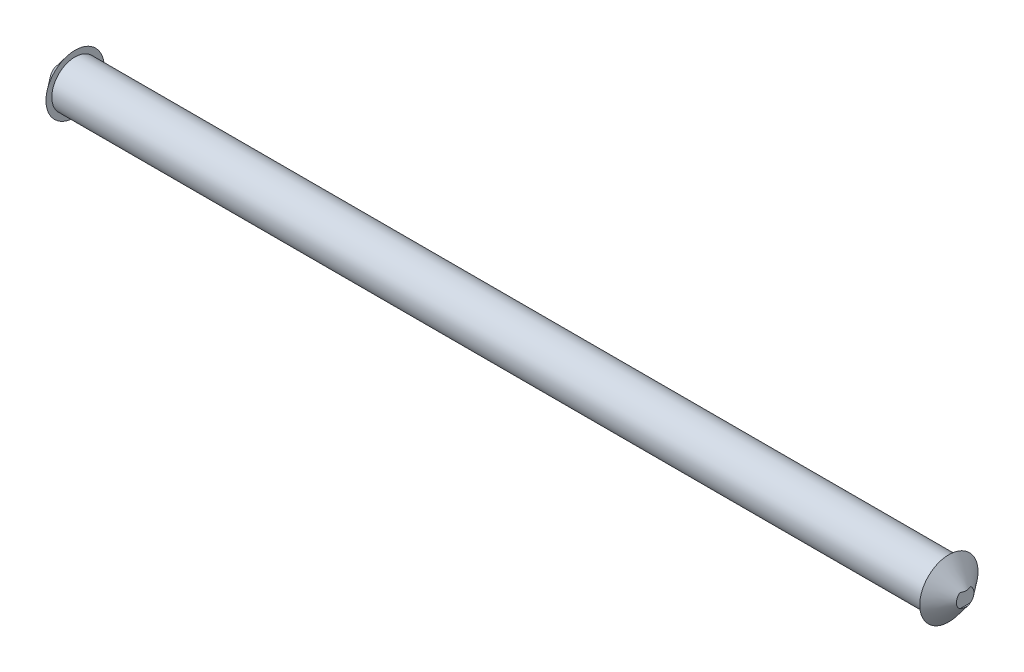
ISO-10303-21;
HEADER;
FILE_DESCRIPTION(('STEP AP214'),'2;1');
FILE_NAME('part.step','',(''),(''),'','','');
FILE_SCHEMA(('AUTOMOTIVE_DESIGN { 1 0 10303 214 1 1 1 1 }'));
ENDSEC;
DATA;
#1=APPLICATION_CONTEXT('core data for automotive mechanical design processes');
#2=APPLICATION_PROTOCOL_DEFINITION('international standard','automotive_design',2000,#1);
#3=PRODUCT_CONTEXT('',#1,'mechanical');
#4=PRODUCT('Part','Part','',(#3));
#5=PRODUCT_RELATED_PRODUCT_CATEGORY('part','',(#4));
#6=PRODUCT_DEFINITION_FORMATION('','',#4);
#7=PRODUCT_DEFINITION_CONTEXT('part definition',#1,'design');
#8=PRODUCT_DEFINITION('design','',#6,#7);
#9=PRODUCT_DEFINITION_SHAPE('','',#8);
#10=(LENGTH_UNIT() NAMED_UNIT(*) SI_UNIT(.MILLI.,.METRE.));
#11=(NAMED_UNIT(*) PLANE_ANGLE_UNIT() SI_UNIT($,.RADIAN.));
#12=(NAMED_UNIT(*) SI_UNIT($,.STERADIAN.) SOLID_ANGLE_UNIT());
#13=UNCERTAINTY_MEASURE_WITH_UNIT(LENGTH_MEASURE(1.E-05),#10,'distance_accuracy_value','');
#14=(GEOMETRIC_REPRESENTATION_CONTEXT(3) GLOBAL_UNCERTAINTY_ASSIGNED_CONTEXT((#13)) GLOBAL_UNIT_ASSIGNED_CONTEXT((#10,
#11,#12)) REPRESENTATION_CONTEXT('',''));
#15=CARTESIAN_POINT('',(0.,0.,0.));
#16=DIRECTION('',(0.,0.,1.));
#17=DIRECTION('',(1.,0.,0.));
#18=AXIS2_PLACEMENT_3D('',#15,#16,#17);
#19=CARTESIAN_POINT('',(197.5,0.,0.));
#20=DIRECTION('',(-1.,0.,0.));
#21=DIRECTION('',(0.,0.,1.));
#22=AXIS2_PLACEMENT_3D('',#19,#20,#21);
#23=CONICAL_SURFACE('',#22,0.,0.896055384571344);
#24=CARTESIAN_POINT('',(187.5,0.,0.));
#25=DIRECTION('',(1.,0.,0.));
#26=DIRECTION('',(0.,0.,-1.));
#27=AXIS2_PLACEMENT_3D('',#24,#25,#26);
#28=CIRCLE('',#27,12.5);
#29=CARTESIAN_POINT('',(187.5,0.,-12.5));
#30=VERTEX_POINT('',#29);
#31=EDGE_CURVE('E152',#30,#30,#28,.T.);
#32=ORIENTED_EDGE('',*,*,#31,.T.);
#33=EDGE_LOOP('',(#32));
#34=FACE_BOUND('',#33,.T.);
#35=CARTESIAN_POINT('',(194.492262498379,0.,0.));
#36=DIRECTION('',(1.,0.,0.));
#37=DIRECTION('',(0.,0.,-1.));
#38=AXIS2_PLACEMENT_3D('',#35,#36,#37);
#39=CIRCLE('',#38,3.75967187702584);
#40=CARTESIAN_POINT('',(194.492262498379,-3.,2.26608310149892));
#41=VERTEX_POINT('',#40);
#42=CARTESIAN_POINT('',(194.492262498379,3.,2.26608310149892));
#43=VERTEX_POINT('',#42);
#44=EDGE_CURVE('E191',#41,#43,#39,.F.);
#45=ORIENTED_EDGE('',*,*,#44,.T.);
#46=CARTESIAN_POINT('',(183.29670557517,3.,-17.498820161943));
#47=CARTESIAN_POINT('',(183.646234391443,3.,-17.0555179935507));
#48=CARTESIAN_POINT('',(183.995545128925,3.,-16.6120435251189));
#49=CARTESIAN_POINT('',(184.69396813607,3.,-15.7241231606544));
#50=CARTESIAN_POINT('',(185.04307973024,3.,-15.2796767333548));
#51=CARTESIAN_POINT('',(185.747038564179,3.,-14.381913889352));
#52=CARTESIAN_POINT('',(186.101871619006,3.,-13.9285863459219));
#53=CARTESIAN_POINT('',(186.810094596255,3.,-13.0216350247952));
#54=CARTESIAN_POINT('',(187.163485701352,3.,-12.5680121711122));
#55=CARTESIAN_POINT('',(187.842502975226,3.,-11.6936000997054));
#56=CARTESIAN_POINT('',(188.168230895602,3.,-11.2728899332515));
#57=CARTESIAN_POINT('',(188.818068938484,3.,-10.4301266225083));
#58=CARTESIAN_POINT('',(189.142178828134,3.,-10.0080732984622));
#59=CARTESIAN_POINT('',(189.789498721798,3.,-9.16021866132439));
#60=CARTESIAN_POINT('',(190.112697844814,3.,-8.73440903445055));
#61=CARTESIAN_POINT('',(190.755359624353,3.,-7.88033402089903));
#62=CARTESIAN_POINT('',(191.074824231114,3.,-7.45207010760142));
#63=CARTESIAN_POINT('',(191.546884463677,3.,-6.81036930304345));
#64=CARTESIAN_POINT('',(191.701654430611,3.,-6.59853318284215));
#65=CARTESIAN_POINT('',(192.009381603457,3.,-6.17354986377727));
#66=CARTESIAN_POINT('',(192.162338829091,3.,-5.96040267921702));
#67=CARTESIAN_POINT('',(192.466192956135,3.,-5.53194212297761));
#68=CARTESIAN_POINT('',(192.617084643465,3.,-5.3166250439403));
#69=CARTESIAN_POINT('',(192.91557401778,3.,-4.88375423999881));
#70=CARTESIAN_POINT('',(193.063172114143,3.,-4.66620079802892));
#71=CARTESIAN_POINT('',(193.352453169119,3.,-4.23003164929146));
#72=CARTESIAN_POINT('',(193.494177881932,3.,-4.0114438574961));
#73=CARTESIAN_POINT('',(193.701848448034,3.,-3.68038056305878));
#74=CARTESIAN_POINT('',(193.77027306688,3.,-3.56946087341555));
#75=CARTESIAN_POINT('',(193.905075033848,3.,-3.34638658063015));
#76=CARTESIAN_POINT('',(193.971452464872,3.,-3.2342320277442));
#77=CARTESIAN_POINT('',(194.101433445878,3.,-3.00887788216624));
#78=CARTESIAN_POINT('',(194.165046395956,3.,-2.89568372891006));
#79=CARTESIAN_POINT('',(194.28912995747,3.,-2.66756161620629));
#80=CARTESIAN_POINT('',(194.349600240848,3.,-2.55263347736041));
#81=CARTESIAN_POINT('',(194.466487688932,3.,-2.32088689022504));
#82=CARTESIAN_POINT('',(194.522909316914,3.,-2.20407070304926));
#83=CARTESIAN_POINT('',(194.630669571733,3.,-1.96812892134171));
#84=CARTESIAN_POINT('',(194.682009825058,3.,-1.8490040804778));
#85=CARTESIAN_POINT('',(194.742321669116,3.,-1.69799414400983));
#86=CARTESIAN_POINT('',(194.75433235337,3.,-1.66731318131802));
#87=CARTESIAN_POINT('',(194.777908383138,3.,-1.60577580406672));
#88=CARTESIAN_POINT('',(194.789473669251,3.,-1.57491936673085));
#89=CARTESIAN_POINT('',(194.823463236899,3.,-1.48207409866269));
#90=CARTESIAN_POINT('',(194.845175968993,3.,-1.41982241691833));
#91=CARTESIAN_POINT('',(194.886456565193,3.,-1.29463418022196));
#92=CARTESIAN_POINT('',(194.906025176515,3.,-1.23169787231789));
#93=CARTESIAN_POINT('',(194.942772097364,3.,-1.10513008154927));
#94=CARTESIAN_POINT('',(194.959950473655,3.,-1.04149861815529));
#95=CARTESIAN_POINT('',(194.991240963676,3.,-0.915248370047356));
#96=CARTESIAN_POINT('',(195.005421575452,3.,-0.852646682951467));
#97=CARTESIAN_POINT('',(195.031035634412,3.,-0.726888963503941));
#98=CARTESIAN_POINT('',(195.042469149841,3.,-0.663732944963658));
#99=CARTESIAN_POINT('',(195.072319300957,3.,-0.473517333743749));
#100=CARTESIAN_POINT('',(195.086283868659,3.,-0.345716758217381));
#101=CARTESIAN_POINT('',(195.101259741742,3.,-0.0868271347396765));
#102=CARTESIAN_POINT('',(195.102010644423,3.,0.0442771233320055));
#103=CARTESIAN_POINT('',(195.08982565588,3.,0.305808048191539));
#104=CARTESIAN_POINT('',(195.076892366451,3.,0.436234839049961));
#105=CARTESIAN_POINT('',(195.038324845377,3.,0.69645019059733));
#106=CARTESIAN_POINT('',(195.012567863331,3.,0.826220092594126));
#107=CARTESIAN_POINT('',(194.950252556368,3.,1.08312294661594));
#108=CARTESIAN_POINT('',(194.913690881168,3.,1.21025506762181));
#109=CARTESIAN_POINT('',(194.824411257637,3.,1.48460573672424));
#110=CARTESIAN_POINT('',(194.769962268817,3.,1.63125339196155));
#111=CARTESIAN_POINT('',(194.651934921077,3.,1.92086546794607));
#112=CARTESIAN_POINT('',(194.588350751728,3.,2.06382747565741));
#113=CARTESIAN_POINT('',(194.454267991559,3.,2.34681155462035));
#114=CARTESIAN_POINT('',(194.38375494006,3.,2.48682670375053));
#115=CARTESIAN_POINT('',(194.237656941281,3.,2.76412356604441));
#116=CARTESIAN_POINT('',(194.16207312467,3.,2.90140587977538));
#117=CARTESIAN_POINT('',(194.005837868725,3.,3.1758881193021));
#118=CARTESIAN_POINT('',(193.925125750963,3.,3.31305332246463));
#119=CARTESIAN_POINT('',(193.760644288864,3.,3.58553800919421));
#120=CARTESIAN_POINT('',(193.676874821476,3.,3.72085741816936));
#121=CARTESIAN_POINT('',(193.507076003445,3.,3.98979113633031));
#122=CARTESIAN_POINT('',(193.421050118672,3.,4.12340764017016));
#123=CARTESIAN_POINT('',(193.247115787703,3.,4.38940066629322));
#124=CARTESIAN_POINT('',(193.159207401809,3.,4.52177722810157));
#125=CARTESIAN_POINT('',(192.959347592394,3.,4.81901704283908));
#126=CARTESIAN_POINT('',(192.846962569453,3.,4.98358841543047));
#127=CARTESIAN_POINT('',(192.620343194152,3.,5.3114543391612));
#128=CARTESIAN_POINT('',(192.506108806134,3.,5.47474886559194));
#129=CARTESIAN_POINT('',(192.16122044069,3.,5.9631224272327));
#130=CARTESIAN_POINT('',(191.928396938732,3.,6.28666838699631));
#131=CARTESIAN_POINT('',(191.458941350057,3.,6.93109380833911));
#132=CARTESIAN_POINT('',(191.2223083358,3.,7.25197259077142));
#133=CARTESIAN_POINT('',(190.746437263315,3.,7.89179630427862));
#134=CARTESIAN_POINT('',(190.507199174403,3.,8.21074121250619));
#135=CARTESIAN_POINT('',(190.026522717104,3.,8.84766957432572));
#136=CARTESIAN_POINT('',(189.785081731392,3.,9.16565104966052));
#137=CARTESIAN_POINT('',(189.300808208052,3.,9.80055652373662));
#138=CARTESIAN_POINT('',(189.057975657228,3.,10.1174805124039));
#139=CARTESIAN_POINT('',(188.327990950273,3.,11.0669494780455));
#140=CARTESIAN_POINT('',(187.839275478818,3.,11.6982920089966));
#141=CARTESIAN_POINT('',(186.918454070048,3.,12.8828800643966));
#142=CARTESIAN_POINT('',(186.486637707102,3.,13.4363511644426));
#143=CARTESIAN_POINT('',(185.621598591811,3.,14.5422356630212));
#144=CARTESIAN_POINT('',(185.188375773378,3.,15.0946490098551));
#145=CARTESIAN_POINT('',(184.321828877846,3.,16.197564151436));
#146=CARTESIAN_POINT('',(183.888506831661,3.,16.7480675428355));
#147=CARTESIAN_POINT('',(183.021133032432,3.,17.848453520256));
#148=CARTESIAN_POINT('',(182.587081317911,3.,18.3983361366382));
#149=CARTESIAN_POINT('',(182.152771170339,3.,18.9480141089198));
#150=B_SPLINE_CURVE_WITH_KNOTS('',3,(#46,#47,#48,#49,#50,#51,#52,#53,#54,#55,#56,#57,#58,#59,
#60,#61,#62,#63,#64,#65,#66,#67,#68,#69,#70,#71,#72,#73,#74,#75,#76,#77,#78,#79,#80,#81,#82,#83,
#84,#85,#86,#87,#88,#89,#90,#91,#92,#93,#94,#95,#96,#97,#98,#99,#100,#101,#102,#103,#104,#105,
#106,#107,#108,#109,#110,#111,#112,#113,#114,#115,#116,#117,#118,#119,#120,#121,#122,#123,#124,
#125,#126,#127,#128,#129,#130,#131,#132,#133,#134,#135,#136,#137,#138,#139,#140,#141,#142,#143,
#144,#145,#146,#147,#148,#149),.UNSPECIFIED.,.F.,.F.,(4,2,2,2,2,2,2,2,2,2,2,2,2,2,2,2,2,2,2,2,2,
2,2,2,2,2,2,2,2,2,2,2,2,2,2,2,2,2,2,2,2,2,2,2,2,2,2,2,2,2,2,4),(0.,1.69357197501904,
3.38906656656963,5.11611822599625,6.84120473489183,8.4374042009055,10.033827116217,
11.6375454851175,13.2403851528,14.0274324705301,14.8144712169746,15.6032244552613,
16.3918791031052,17.1733205119163,17.5642844646491,17.9552325643917,18.3447263687838,
18.7342607503941,19.1233588895411,19.5123320773973,19.6111738138473,19.710028686806,
19.907780777976,20.1054637328776,20.3031411650112,20.4956436556128,20.6881413634888,
21.0731570506091,21.465751956047,21.8582722302477,22.2546241707396,22.6510991398652,
23.1199665045592,23.5891334233758,24.0593011815282,24.5293644489147,25.0067637560353,
25.4841822989109,25.9609061219201,26.437614696519,27.0354496607616,27.6332961653832,
28.8290728077067,30.0251451379679,31.2212315715303,32.4189970950164,33.6167739964968,
36.0119492030726,38.1179292684814,40.2240097646661,42.3257697499059,44.4274220540545),.UNSPECIFIED.);
#151=CARTESIAN_POINT('',(194.492262498379,3.,-2.26608310149892));
#152=VERTEX_POINT('',#151);
#153=EDGE_CURVE('E88',#43,#152,#150,.F.);
#154=ORIENTED_EDGE('',*,*,#153,.T.);
#155=CARTESIAN_POINT('',(194.492262498379,-3.,-2.26608310149892));
#156=VERTEX_POINT('',#155);
#157=EDGE_CURVE('E164',#152,#156,#39,.F.);
#158=ORIENTED_EDGE('',*,*,#157,.T.);
#159=CARTESIAN_POINT('',(183.29670557517,-3.,-17.498820161943));
#160=CARTESIAN_POINT('',(183.646234391443,-3.,-17.0555179935507));
#161=CARTESIAN_POINT('',(183.995545128925,-3.,-16.6120435251189));
#162=CARTESIAN_POINT('',(184.69396813607,-3.,-15.7241231606544));
#163=CARTESIAN_POINT('',(185.04307973024,-3.,-15.2796767333548));
#164=CARTESIAN_POINT('',(185.747038564179,-3.,-14.381913889352));
#165=CARTESIAN_POINT('',(186.101871619006,-3.,-13.9285863459219));
#166=CARTESIAN_POINT('',(186.810094596255,-3.,-13.0216350247952));
#167=CARTESIAN_POINT('',(187.163485701352,-3.,-12.5680121711122));
#168=CARTESIAN_POINT('',(187.842502975226,-3.,-11.6936000997054));
#169=CARTESIAN_POINT('',(188.168230895602,-3.,-11.2728899332515));
#170=CARTESIAN_POINT('',(188.818068938484,-3.,-10.4301266225083));
#171=CARTESIAN_POINT('',(189.142178828134,-3.,-10.0080732984622));
#172=CARTESIAN_POINT('',(189.789498721798,-3.,-9.16021866132439));
#173=CARTESIAN_POINT('',(190.112697844814,-3.,-8.73440903445055));
#174=CARTESIAN_POINT('',(190.755359624353,-3.,-7.88033402089903));
#175=CARTESIAN_POINT('',(191.074824231114,-3.,-7.45207010760142));
#176=CARTESIAN_POINT('',(191.546884463677,-3.,-6.81036930304345));
#177=CARTESIAN_POINT('',(191.701654430611,-3.,-6.59853318284215));
#178=CARTESIAN_POINT('',(192.009381603457,-3.,-6.17354986377727));
#179=CARTESIAN_POINT('',(192.162338829091,-3.,-5.96040267921702));
#180=CARTESIAN_POINT('',(192.466192956135,-3.,-5.53194212297761));
#181=CARTESIAN_POINT('',(192.617084643465,-3.,-5.3166250439403));
#182=CARTESIAN_POINT('',(192.91557401778,-3.,-4.88375423999881));
#183=CARTESIAN_POINT('',(193.063172114143,-3.,-4.66620079802892));
#184=CARTESIAN_POINT('',(193.352453169119,-3.,-4.23003164929146));
#185=CARTESIAN_POINT('',(193.494177881932,-3.,-4.0114438574961));
#186=CARTESIAN_POINT('',(193.701848448034,-3.,-3.68038056305878));
#187=CARTESIAN_POINT('',(193.77027306688,-3.,-3.56946087341555));
#188=CARTESIAN_POINT('',(193.905075033848,-3.,-3.34638658063015));
#189=CARTESIAN_POINT('',(193.971452464872,-3.,-3.2342320277442));
#190=CARTESIAN_POINT('',(194.101433445878,-3.,-3.00887788216624));
#191=CARTESIAN_POINT('',(194.165046395956,-3.,-2.89568372891006));
#192=CARTESIAN_POINT('',(194.28912995747,-3.,-2.66756161620629));
#193=CARTESIAN_POINT('',(194.349600240848,-3.,-2.55263347736041));
#194=CARTESIAN_POINT('',(194.466487688932,-3.,-2.32088689022504));
#195=CARTESIAN_POINT('',(194.522909316914,-3.,-2.20407070304926));
#196=CARTESIAN_POINT('',(194.630669571733,-3.,-1.96812892134171));
#197=CARTESIAN_POINT('',(194.682009825058,-3.,-1.8490040804778));
#198=CARTESIAN_POINT('',(194.742321669116,-3.,-1.69799414400983));
#199=CARTESIAN_POINT('',(194.75433235337,-3.,-1.66731318131802));
#200=CARTESIAN_POINT('',(194.777908383138,-3.,-1.60577580406672));
#201=CARTESIAN_POINT('',(194.789473669251,-3.,-1.57491936673085));
#202=CARTESIAN_POINT('',(194.823463236899,-3.,-1.48207409866269));
#203=CARTESIAN_POINT('',(194.845175968993,-3.,-1.41982241691833));
#204=CARTESIAN_POINT('',(194.886456565193,-3.,-1.29463418022196));
#205=CARTESIAN_POINT('',(194.906025176515,-3.,-1.23169787231789));
#206=CARTESIAN_POINT('',(194.942772097364,-3.,-1.10513008154927));
#207=CARTESIAN_POINT('',(194.959950473655,-3.,-1.04149861815529));
#208=CARTESIAN_POINT('',(194.991240963676,-3.,-0.915248370047356));
#209=CARTESIAN_POINT('',(195.005421575452,-3.,-0.852646682951467));
#210=CARTESIAN_POINT('',(195.031035634412,-3.,-0.726888963503941));
#211=CARTESIAN_POINT('',(195.042469149841,-3.,-0.663732944963658));
#212=CARTESIAN_POINT('',(195.072319300957,-3.,-0.473517333743749));
#213=CARTESIAN_POINT('',(195.086283868659,-3.,-0.345716758217381));
#214=CARTESIAN_POINT('',(195.101259741742,-3.,-0.0868271347396765));
#215=CARTESIAN_POINT('',(195.102010644423,-3.,0.0442771233320055));
#216=CARTESIAN_POINT('',(195.08982565588,-3.,0.305808048191539));
#217=CARTESIAN_POINT('',(195.076892366451,-3.,0.436234839049961));
#218=CARTESIAN_POINT('',(195.038324845377,-3.,0.69645019059733));
#219=CARTESIAN_POINT('',(195.012567863331,-3.,0.826220092594126));
#220=CARTESIAN_POINT('',(194.950252556368,-3.,1.08312294661594));
#221=CARTESIAN_POINT('',(194.913690881168,-3.,1.21025506762181));
#222=CARTESIAN_POINT('',(194.824411257637,-3.,1.48460573672424));
#223=CARTESIAN_POINT('',(194.769962268817,-3.,1.63125339196155));
#224=CARTESIAN_POINT('',(194.651934921077,-3.,1.92086546794607));
#225=CARTESIAN_POINT('',(194.588350751728,-3.,2.06382747565741));
#226=CARTESIAN_POINT('',(194.454267991559,-3.,2.34681155462035));
#227=CARTESIAN_POINT('',(194.38375494006,-3.,2.48682670375053));
#228=CARTESIAN_POINT('',(194.237656941281,-3.,2.76412356604441));
#229=CARTESIAN_POINT('',(194.16207312467,-3.,2.90140587977538));
#230=CARTESIAN_POINT('',(194.005837868725,-3.,3.1758881193021));
#231=CARTESIAN_POINT('',(193.925125750963,-3.,3.31305332246463));
#232=CARTESIAN_POINT('',(193.760644288864,-3.,3.58553800919421));
#233=CARTESIAN_POINT('',(193.676874821476,-3.,3.72085741816936));
#234=CARTESIAN_POINT('',(193.507076003445,-3.,3.98979113633031));
#235=CARTESIAN_POINT('',(193.421050118672,-3.,4.12340764017016));
#236=CARTESIAN_POINT('',(193.247115787703,-3.,4.38940066629322));
#237=CARTESIAN_POINT('',(193.159207401809,-3.,4.52177722810157));
#238=CARTESIAN_POINT('',(192.959347592394,-3.,4.81901704283908));
#239=CARTESIAN_POINT('',(192.846962569453,-3.,4.98358841543047));
#240=CARTESIAN_POINT('',(192.620343194152,-3.,5.3114543391612));
#241=CARTESIAN_POINT('',(192.506108806134,-3.,5.47474886559194));
#242=CARTESIAN_POINT('',(192.16122044069,-3.,5.9631224272327));
#243=CARTESIAN_POINT('',(191.928396938732,-3.,6.28666838699631));
#244=CARTESIAN_POINT('',(191.458941350057,-3.,6.93109380833911));
#245=CARTESIAN_POINT('',(191.2223083358,-3.,7.25197259077142));
#246=CARTESIAN_POINT('',(190.746437263315,-3.,7.89179630427862));
#247=CARTESIAN_POINT('',(190.507199174403,-3.,8.21074121250619));
#248=CARTESIAN_POINT('',(190.026522717104,-3.,8.84766957432572));
#249=CARTESIAN_POINT('',(189.785081731392,-3.,9.16565104966052));
#250=CARTESIAN_POINT('',(189.300808208052,-3.,9.80055652373662));
#251=CARTESIAN_POINT('',(189.057975657228,-3.,10.1174805124039));
#252=CARTESIAN_POINT('',(188.327990950273,-3.,11.0669494780455));
#253=CARTESIAN_POINT('',(187.839275478818,-3.,11.6982920089966));
#254=CARTESIAN_POINT('',(186.918454070048,-3.,12.8828800643966));
#255=CARTESIAN_POINT('',(186.486637707102,-3.,13.4363511644426));
#256=CARTESIAN_POINT('',(185.621598591811,-3.,14.5422356630212));
#257=CARTESIAN_POINT('',(185.188375773378,-3.,15.0946490098551));
#258=CARTESIAN_POINT('',(184.321828877846,-3.,16.197564151436));
#259=CARTESIAN_POINT('',(183.888506831661,-3.,16.7480675428355));
#260=CARTESIAN_POINT('',(183.021133032432,-3.,17.848453520256));
#261=CARTESIAN_POINT('',(182.587081317911,-3.,18.3983361366382));
#262=CARTESIAN_POINT('',(182.152771170339,-3.,18.9480141089198));
#263=B_SPLINE_CURVE_WITH_KNOTS('',3,(#159,#160,#161,#162,#163,#164,#165,#166,#167,#168,#169,
#170,#171,#172,#173,#174,#175,#176,#177,#178,#179,#180,#181,#182,#183,#184,#185,#186,#187,#188,
#189,#190,#191,#192,#193,#194,#195,#196,#197,#198,#199,#200,#201,#202,#203,#204,#205,#206,#207,
#208,#209,#210,#211,#212,#213,#214,#215,#216,#217,#218,#219,#220,#221,#222,#223,#224,#225,#226,
#227,#228,#229,#230,#231,#232,#233,#234,#235,#236,#237,#238,#239,#240,#241,#242,#243,#244,#245,
#246,#247,#248,#249,#250,#251,#252,#253,#254,#255,#256,#257,#258,#259,#260,#261,#262),
.UNSPECIFIED.,.F.,.F.,(4,2,2,2,2,2,2,2,2,2,2,2,2,2,2,2,2,2,2,2,2,2,2,2,2,2,2,2,2,2,2,2,2,2,2,2,
2,2,2,2,2,2,2,2,2,2,2,2,2,2,2,4),(0.,1.69357197501904,3.38906656656963,5.11611822599625,
6.84120473489183,8.4374042009055,10.033827116217,11.6375454851175,13.2403851528,
14.0274324705301,14.8144712169746,15.6032244552613,16.3918791031052,17.1733205119163,
17.5642844646491,17.9552325643917,18.3447263687838,18.7342607503941,19.1233588895411,
19.5123320773973,19.6111738138473,19.710028686806,19.907780777976,20.1054637328776,
20.3031411650112,20.4956436556128,20.6881413634888,21.0731570506091,21.465751956047,
21.8582722302477,22.2546241707396,22.6510991398652,23.1199665045592,23.5891334233758,
24.0593011815282,24.5293644489147,25.0067637560353,25.4841822989109,25.9609061219201,
26.437614696519,27.0354496607616,27.6332961653832,28.8290728077067,30.0251451379679,
31.2212315715303,32.4189970950164,33.6167739964968,36.0119492030726,38.1179292684814,
40.2240097646661,42.3257697499059,44.4274220540545),.UNSPECIFIED.);
#264=EDGE_CURVE('E158',#156,#41,#263,.T.);
#265=ORIENTED_EDGE('',*,*,#264,.T.);
#266=EDGE_LOOP('',(#45,#154,#158,#265));
#267=FACE_BOUND('',#266,.T.);
#268=ADVANCED_FACE('F39',(#34,#267),#23,.T.);
#269=CARTESIAN_POINT('',(187.5,0.,0.));
#270=DIRECTION('',(-1.,0.,0.));
#271=DIRECTION('',(0.,0.,1.));
#272=AXIS2_PLACEMENT_3D('',#269,#270,#271);
#273=CYLINDRICAL_SURFACE('',#272,10.);
#274=CARTESIAN_POINT('',(187.5,0.,0.));
#275=DIRECTION('',(1.,0.,0.));
#276=DIRECTION('',(0.,0.,-1.));
#277=AXIS2_PLACEMENT_3D('',#274,#275,#276);
#278=CIRCLE('',#277,10.);
#279=CARTESIAN_POINT('',(187.5,0.,-10.));
#280=VERTEX_POINT('',#279);
#281=EDGE_CURVE('E155',#280,#280,#278,.T.);
#282=ORIENTED_EDGE('',*,*,#281,.F.);
#283=EDGE_LOOP('',(#282));
#284=FACE_BOUND('',#283,.T.);
#285=CARTESIAN_POINT('',(-187.5,0.,0.));
#286=DIRECTION('',(-1.,0.,0.));
#287=DIRECTION('',(0.,0.,1.));
#288=AXIS2_PLACEMENT_3D('',#285,#286,#287);
#289=CIRCLE('',#288,10.);
#290=CARTESIAN_POINT('',(-187.5,0.,10.));
#291=VERTEX_POINT('',#290);
#292=EDGE_CURVE('E146',#291,#291,#289,.T.);
#293=ORIENTED_EDGE('',*,*,#292,.F.);
#294=EDGE_LOOP('',(#293));
#295=FACE_BOUND('',#294,.T.);
#296=ADVANCED_FACE('F41',(#284,#295),#273,.T.);
#297=CARTESIAN_POINT('',(187.5,0.,0.));
#298=DIRECTION('',(1.,0.,0.));
#299=DIRECTION('',(0.,0.,-1.));
#300=AXIS2_PLACEMENT_3D('',#297,#298,#299);
#301=PLANE('',#300);
#302=ORIENTED_EDGE('',*,*,#281,.T.);
#303=EDGE_LOOP('',(#302));
#304=FACE_BOUND('',#303,.T.);
#305=ORIENTED_EDGE('',*,*,#31,.F.);
#306=EDGE_LOOP('',(#305));
#307=FACE_BOUND('',#306,.T.);
#308=ADVANCED_FACE('F118',(#304,#307),#301,.F.);
#309=CARTESIAN_POINT('',(-187.5,0.,0.));
#310=DIRECTION('',(-1.,0.,0.));
#311=DIRECTION('',(0.,0.,-1.));
#312=AXIS2_PLACEMENT_3D('',#309,#310,#311);
#313=PLANE('',#312);
#314=ORIENTED_EDGE('',*,*,#292,.T.);
#315=EDGE_LOOP('',(#314));
#316=FACE_BOUND('',#315,.T.);
#317=CARTESIAN_POINT('',(-187.5,0.,0.));
#318=DIRECTION('',(1.,0.,0.));
#319=DIRECTION('',(0.,0.,-1.));
#320=AXIS2_PLACEMENT_3D('',#317,#318,#319);
#321=CIRCLE('',#320,12.5);
#322=CARTESIAN_POINT('',(-187.5,0.,-12.5));
#323=VERTEX_POINT('',#322);
#324=EDGE_CURVE('E136',#323,#323,#321,.T.);
#325=ORIENTED_EDGE('',*,*,#324,.T.);
#326=EDGE_LOOP('',(#325));
#327=FACE_BOUND('',#326,.T.);
#328=ADVANCED_FACE('F116',(#316,#327),#313,.F.);
#329=CARTESIAN_POINT('',(-197.5,0.,0.));
#330=DIRECTION('',(1.,0.,0.));
#331=DIRECTION('',(0.,0.,1.));
#332=AXIS2_PLACEMENT_3D('',#329,#330,#331);
#333=CONICAL_SURFACE('',#332,0.,0.896055384571344);
#334=CARTESIAN_POINT('',(-183.296607290248,-3.,-17.4989448104847));
#335=CARTESIAN_POINT('',(-183.646139414276,-3.,-17.0556385371724));
#336=CARTESIAN_POINT('',(-183.995453460128,-3.,-16.612159964273));
#337=CARTESIAN_POINT('',(-184.693883072902,-3.,-15.7242314071994));
#338=CARTESIAN_POINT('',(-185.042997964361,-3.,-15.2797808917806));
#339=CARTESIAN_POINT('',(-185.746963202005,-3.,-14.3820101190244));
#340=CARTESIAN_POINT('',(-186.101799363825,-3.,-13.92867873541));
#341=CARTESIAN_POINT('',(-186.810028570205,-3.,-13.0217197187344));
#342=CARTESIAN_POINT('',(-187.163422797387,-3.,-12.5680930096475));
#343=CARTESIAN_POINT('',(-187.842444519709,-3.,-11.6936755307394));
#344=CARTESIAN_POINT('',(-188.168173772123,-3.,-11.2729638166269));
#345=CARTESIAN_POINT('',(-188.818014496522,-3.,-10.4301974271077));
#346=CARTESIAN_POINT('',(-189.142125735664,-3.,-10.008142571954));
#347=CARTESIAN_POINT('',(-189.789448299975,-3.,-9.16028497148537));
#348=CARTESIAN_POINT('',(-190.112648744758,-3.,-8.73447391285047));
#349=CARTESIAN_POINT('',(-190.755313224992,-3.,-7.88039606212566));
#350=CARTESIAN_POINT('',(-191.074779210567,-3.,-7.45213074333187));
#351=CARTESIAN_POINT('',(-191.54684168634,-3.,-6.81042772607053));
#352=CARTESIAN_POINT('',(-191.701612482203,-3.,-6.59859077460288));
#353=CARTESIAN_POINT('',(-192.009341340446,-3.,-6.17360581078388));
#354=CARTESIAN_POINT('',(-192.162299422549,-3.,-5.96045781273511));
#355=CARTESIAN_POINT('',(-192.466155288396,-3.,-5.53199567221964));
#356=CARTESIAN_POINT('',(-192.617047858372,-3.,-5.3166778226099));
#357=CARTESIAN_POINT('',(-192.915539055515,-3.,-4.88380551013254));
#358=CARTESIAN_POINT('',(-193.063138092037,-3.,-4.66625133018423));
#359=CARTESIAN_POINT('',(-193.352421161843,-3.,-4.23008067120894));
#360=CARTESIAN_POINT('',(-193.49414694673,-3.,-4.01149210551043));
#361=CARTESIAN_POINT('',(-193.701819214062,-3.,-3.68042769721998));
#362=CARTESIAN_POINT('',(-193.770244414853,-3.,-3.56950764546443));
#363=CARTESIAN_POINT('',(-193.905047586111,-3.,-3.34643264564461));
#364=CARTESIAN_POINT('',(-193.971425639472,-3.,-3.23427774783349));
#365=CARTESIAN_POINT('',(-194.101407924495,-3.,-3.0089229148401));
#366=CARTESIAN_POINT('',(-194.165021555652,-3.,-2.89572841878417));
#367=CARTESIAN_POINT('',(-194.289106542807,-3.,-2.66760564117101));
#368=CARTESIAN_POINT('',(-194.349577570767,-3.,-2.55267718022419));
#369=CARTESIAN_POINT('',(-194.466466590619,-3.,-2.32092996320237));
#370=CARTESIAN_POINT('',(-194.522889045507,-3.,-2.20411346812342));
#371=CARTESIAN_POINT('',(-194.630651054224,-3.,-1.9681710840329));
#372=CARTESIAN_POINT('',(-194.681992234443,-3.,-1.84904594865378));
#373=CARTESIAN_POINT('',(-194.7423053686,-3.,-1.69803550852865));
#374=CARTESIAN_POINT('',(-194.754316358903,-3.,-1.66735433621473));
#375=CARTESIAN_POINT('',(-194.777893004511,-3.,-1.6058165380183));
#376=CARTESIAN_POINT('',(-194.78945860042,-3.,-1.57495988936013));
#377=CARTESIAN_POINT('',(-194.823449102763,-3.,-1.48211398453008));
#378=CARTESIAN_POINT('',(-194.845162465197,-3.,-1.41986187398838));
#379=CARTESIAN_POINT('',(-194.88644433396,-3.,-1.29467276591844));
#380=CARTESIAN_POINT('',(-194.906013587468,-3.,-1.23173601543194));
#381=CARTESIAN_POINT('',(-194.94276179971,-3.,-1.10516732190957));
#382=CARTESIAN_POINT('',(-194.959940825201,-3.,-1.04153539834301));
#383=CARTESIAN_POINT('',(-194.991232595521,-3.,-0.915284223877019));
#384=CARTESIAN_POINT('',(-195.005413838555,-3.,-0.852682071209654));
#385=CARTESIAN_POINT('',(-195.031029150992,-3.,-0.726923395697043));
#386=CARTESIAN_POINT('',(-195.04246328864,-3.,-0.663766886663861));
#387=CARTESIAN_POINT('',(-195.072315276294,-3.,-0.47354976320706));
#388=CARTESIAN_POINT('',(-195.086281028754,-3.,-0.34574812275548));
#389=CARTESIAN_POINT('',(-195.101259111703,-3.,-0.0868560892344249));
#390=CARTESIAN_POINT('',(-195.102011021298,-3.,0.0442495171748573));
#391=CARTESIAN_POINT('',(-195.089827722244,-3.,0.305783219015802));
#392=CARTESIAN_POINT('',(-195.076895115594,-3.,0.43621143850924));
#393=CARTESIAN_POINT('',(-195.038328615557,-3.,0.696429660585925));
#394=CARTESIAN_POINT('',(-195.012571969989,-3.,0.82620100489176));
#395=CARTESIAN_POINT('',(-194.95025701844,-3.,1.08310671245146));
#396=CARTESIAN_POINT('',(-194.913695361775,-3.,1.21024024460006));
#397=CARTESIAN_POINT('',(-194.824416639974,-3.,1.48459044592429));
#398=CARTESIAN_POINT('',(-194.769968769301,-3.,1.63123630403995));
#399=CARTESIAN_POINT('',(-194.651943781587,-3.,1.92084486465711));
#400=CARTESIAN_POINT('',(-194.588360854346,-3.,2.06380515423732));
#401=CARTESIAN_POINT('',(-194.454280650004,-3.,2.34678583991591));
#402=CARTESIAN_POINT('',(-194.383768912722,-3.,2.48679931417894));
#403=CARTESIAN_POINT('',(-194.237673575093,-3.,2.76409286294561));
#404=CARTESIAN_POINT('',(-194.162091105373,-3.,2.90137353799006));
#405=CARTESIAN_POINT('',(-194.00585855728,-3.,3.17585253598626));
#406=CARTESIAN_POINT('',(-193.925147799572,-3.,3.31301613597736));
#407=CARTESIAN_POINT('',(-193.760669062492,-3.,3.5854976278898));
#408=CARTESIAN_POINT('',(-193.676900960071,-3.,3.72081544522253));
#409=CARTESIAN_POINT('',(-193.507104867387,-3.,3.98974599285062));
#410=CARTESIAN_POINT('',(-193.421080342922,-3.,4.12336091774525));
#411=CARTESIAN_POINT('',(-193.247148730004,-3.,4.38935078902112));
#412=CARTESIAN_POINT('',(-193.159241701854,-3.,4.52172577492732));
#413=CARTESIAN_POINT('',(-192.959385242029,-3.,4.8189616023601));
#414=CARTESIAN_POINT('',(-192.847002216165,-3.,4.98353056804263));
#415=CARTESIAN_POINT('',(-192.620386837082,-3.,5.31139168318445));
#416=CARTESIAN_POINT('',(-192.506154448205,-3.,5.47468380793473));
#417=CARTESIAN_POINT('',(-192.16127207921,-3.,5.96305016815886));
#418=CARTESIAN_POINT('',(-191.928452573669,-3.,6.28659133161311));
#419=CARTESIAN_POINT('',(-191.459004967167,-3.,6.93100715939123));
#420=CARTESIAN_POINT('',(-191.22237593864,-3.,7.25188114455038));
#421=CARTESIAN_POINT('',(-190.746512826456,-3.,7.89169525858978));
#422=CARTESIAN_POINT('',(-190.507278712114,-3.,8.21063536462193));
#423=CARTESIAN_POINT('',(-190.026610196888,-3.,8.84755411246187));
#424=CARTESIAN_POINT('',(-189.785173178646,-3.,9.16553077599095));
#425=CARTESIAN_POINT('',(-189.300907581117,-3.,9.80042662076198));
#426=CARTESIAN_POINT('',(-189.058078988633,-3.,10.1173457919296));
#427=CARTESIAN_POINT('',(-188.328106145779,-3.,11.0668002962278));
#428=CARTESIAN_POINT('',(-187.839398568431,-3.,11.6981331755937));
#429=CARTESIAN_POINT('',(-186.918592668502,-3.,12.8827021842524));
#430=CARTESIAN_POINT('',(-186.486783926012,-3.,13.4361638934399));
#431=CARTESIAN_POINT('',(-185.621760041939,-3.,14.5420296036961));
#432=CARTESIAN_POINT('',(-185.188544834267,-3.,15.0944335530644));
#433=CARTESIAN_POINT('',(-184.322013150583,-3.,16.1973298955024));
#434=CARTESIAN_POINT('',(-183.888698705535,-3.,16.7478238852614));
#435=CARTESIAN_POINT('',(-183.021340102216,-3.,17.8481910542622));
#436=CARTESIAN_POINT('',(-182.58729598247,-3.,18.3980642638662));
#437=CARTESIAN_POINT('',(-182.152993427054,-3.,18.9477328273584));
#438=B_SPLINE_CURVE_WITH_KNOTS('',3,(#334,#335,#336,#337,#338,#339,#340,#341,#342,#343,#344,
#345,#346,#347,#348,#349,#350,#351,#352,#353,#354,#355,#356,#357,#358,#359,#360,#361,#362,#363,
#364,#365,#366,#367,#368,#369,#370,#371,#372,#373,#374,#375,#376,#377,#378,#379,#380,#381,#382,
#383,#384,#385,#386,#387,#388,#389,#390,#391,#392,#393,#394,#395,#396,#397,#398,#399,#400,#401,
#402,#403,#404,#405,#406,#407,#408,#409,#410,#411,#412,#413,#414,#415,#416,#417,#418,#419,#420,
#421,#422,#423,#424,#425,#426,#427,#428,#429,#430,#431,#432,#433,#434,#435,#436,#437),
.UNSPECIFIED.,.F.,.F.,(4,2,2,2,2,2,2,2,2,2,2,2,2,2,2,2,2,2,2,2,2,2,2,2,2,2,2,2,2,2,2,2,2,2,2,2,
2,2,2,2,2,2,2,2,2,2,2,2,2,2,2,4),(0.,1.69358778945313,3.38909813608086,5.11616461263149,
6.84126600191483,8.43747158563201,10.0339006099607,11.6376247978672,13.2404703197421,
14.0275211183653,14.8145633460123,15.6033199979047,16.391978062689,17.1734231730089,
17.5643889676023,17.9553389098744,18.3448346134245,18.7343708929016,19.123470946298,
19.5124460528683,19.611288709655,19.7101445025069,19.9078984317512,20.1055832270905,
20.3032625001025,20.4957667713515,20.6882662597992,21.0732855006323,21.4658844458007,
21.8584087548852,22.2547647177024,22.6512437215326,23.1201048757474,23.5892655724323,
24.0594270705229,24.5294840824922,25.0068771749729,25.4842895022306,25.9610071330897,
26.4377095157771,27.0355351381769,27.633372301011,28.8291302603909,30.02518391065,
31.2212516644306,32.418998493235,33.6167567000852,36.011894513431,38.1178383040848,
40.2238825262436,42.3256062445466,44.4272222808626),.UNSPECIFIED.);
#439=CARTESIAN_POINT('',(-194.492262498379,-3.,-2.26608310149892));
#440=VERTEX_POINT('',#439);
#441=CARTESIAN_POINT('',(-194.492262498379,-3.,2.26608310149892));
#442=VERTEX_POINT('',#441);
#443=EDGE_CURVE('E12',#440,#442,#438,.T.);
#444=ORIENTED_EDGE('',*,*,#443,.F.);
#445=CARTESIAN_POINT('',(-194.492262498379,0.,0.));
#446=DIRECTION('',(1.,0.,0.));
#447=DIRECTION('',(0.,0.,-1.));
#448=AXIS2_PLACEMENT_3D('',#445,#446,#447);
#449=CIRCLE('',#448,3.75967187702584);
#450=CARTESIAN_POINT('',(-194.492262498379,3.,-2.26608310149892));
#451=VERTEX_POINT('',#450);
#452=EDGE_CURVE('E87',#451,#440,#449,.F.);
#453=ORIENTED_EDGE('',*,*,#452,.F.);
#454=CARTESIAN_POINT('',(-183.296607290248,3.,-17.4989448104847));
#455=CARTESIAN_POINT('',(-183.646139414276,3.,-17.0556385371724));
#456=CARTESIAN_POINT('',(-183.995453460128,3.,-16.612159964273));
#457=CARTESIAN_POINT('',(-184.693883072902,3.,-15.7242314071994));
#458=CARTESIAN_POINT('',(-185.042997964361,3.,-15.2797808917806));
#459=CARTESIAN_POINT('',(-185.746963202005,3.,-14.3820101190244));
#460=CARTESIAN_POINT('',(-186.101799363825,3.,-13.92867873541));
#461=CARTESIAN_POINT('',(-186.810028570205,3.,-13.0217197187344));
#462=CARTESIAN_POINT('',(-187.163422797387,3.,-12.5680930096475));
#463=CARTESIAN_POINT('',(-187.842444519709,3.,-11.6936755307394));
#464=CARTESIAN_POINT('',(-188.168173772123,3.,-11.2729638166269));
#465=CARTESIAN_POINT('',(-188.818014496522,3.,-10.4301974271077));
#466=CARTESIAN_POINT('',(-189.142125735664,3.,-10.008142571954));
#467=CARTESIAN_POINT('',(-189.789448299975,3.,-9.16028497148537));
#468=CARTESIAN_POINT('',(-190.112648744758,3.,-8.73447391285047));
#469=CARTESIAN_POINT('',(-190.755313224992,3.,-7.88039606212566));
#470=CARTESIAN_POINT('',(-191.074779210567,3.,-7.45213074333187));
#471=CARTESIAN_POINT('',(-191.54684168634,3.,-6.81042772607053));
#472=CARTESIAN_POINT('',(-191.701612482203,3.,-6.59859077460288));
#473=CARTESIAN_POINT('',(-192.009341340446,3.,-6.17360581078388));
#474=CARTESIAN_POINT('',(-192.162299422549,3.,-5.96045781273511));
#475=CARTESIAN_POINT('',(-192.466155288396,3.,-5.53199567221964));
#476=CARTESIAN_POINT('',(-192.617047858372,3.,-5.3166778226099));
#477=CARTESIAN_POINT('',(-192.915539055515,3.,-4.88380551013254));
#478=CARTESIAN_POINT('',(-193.063138092037,3.,-4.66625133018423));
#479=CARTESIAN_POINT('',(-193.352421161843,3.,-4.23008067120894));
#480=CARTESIAN_POINT('',(-193.49414694673,3.,-4.01149210551043));
#481=CARTESIAN_POINT('',(-193.701819214062,3.,-3.68042769721998));
#482=CARTESIAN_POINT('',(-193.770244414853,3.,-3.56950764546443));
#483=CARTESIAN_POINT('',(-193.905047586111,3.,-3.34643264564461));
#484=CARTESIAN_POINT('',(-193.971425639472,3.,-3.23427774783349));
#485=CARTESIAN_POINT('',(-194.101407924495,3.,-3.0089229148401));
#486=CARTESIAN_POINT('',(-194.165021555652,3.,-2.89572841878417));
#487=CARTESIAN_POINT('',(-194.289106542807,3.,-2.66760564117101));
#488=CARTESIAN_POINT('',(-194.349577570767,3.,-2.55267718022419));
#489=CARTESIAN_POINT('',(-194.466466590619,3.,-2.32092996320237));
#490=CARTESIAN_POINT('',(-194.522889045507,3.,-2.20411346812342));
#491=CARTESIAN_POINT('',(-194.630651054224,3.,-1.9681710840329));
#492=CARTESIAN_POINT('',(-194.681992234443,3.,-1.84904594865378));
#493=CARTESIAN_POINT('',(-194.7423053686,3.,-1.69803550852865));
#494=CARTESIAN_POINT('',(-194.754316358903,3.,-1.66735433621473));
#495=CARTESIAN_POINT('',(-194.777893004511,3.,-1.6058165380183));
#496=CARTESIAN_POINT('',(-194.78945860042,3.,-1.57495988936013));
#497=CARTESIAN_POINT('',(-194.823449102763,3.,-1.48211398453008));
#498=CARTESIAN_POINT('',(-194.845162465197,3.,-1.41986187398838));
#499=CARTESIAN_POINT('',(-194.88644433396,3.,-1.29467276591844));
#500=CARTESIAN_POINT('',(-194.906013587468,3.,-1.23173601543194));
#501=CARTESIAN_POINT('',(-194.94276179971,3.,-1.10516732190957));
#502=CARTESIAN_POINT('',(-194.959940825201,3.,-1.04153539834301));
#503=CARTESIAN_POINT('',(-194.991232595521,3.,-0.915284223877019));
#504=CARTESIAN_POINT('',(-195.005413838555,3.,-0.852682071209654));
#505=CARTESIAN_POINT('',(-195.031029150992,3.,-0.726923395697043));
#506=CARTESIAN_POINT('',(-195.04246328864,3.,-0.663766886663861));
#507=CARTESIAN_POINT('',(-195.072315276294,3.,-0.47354976320706));
#508=CARTESIAN_POINT('',(-195.086281028754,3.,-0.34574812275548));
#509=CARTESIAN_POINT('',(-195.101259111703,3.,-0.0868560892344249));
#510=CARTESIAN_POINT('',(-195.102011021298,3.,0.0442495171748573));
#511=CARTESIAN_POINT('',(-195.089827722244,3.,0.305783219015802));
#512=CARTESIAN_POINT('',(-195.076895115594,3.,0.43621143850924));
#513=CARTESIAN_POINT('',(-195.038328615557,3.,0.696429660585925));
#514=CARTESIAN_POINT('',(-195.012571969989,3.,0.82620100489176));
#515=CARTESIAN_POINT('',(-194.95025701844,3.,1.08310671245146));
#516=CARTESIAN_POINT('',(-194.913695361775,3.,1.21024024460006));
#517=CARTESIAN_POINT('',(-194.824416639974,3.,1.48459044592429));
#518=CARTESIAN_POINT('',(-194.769968769301,3.,1.63123630403995));
#519=CARTESIAN_POINT('',(-194.651943781587,3.,1.92084486465711));
#520=CARTESIAN_POINT('',(-194.588360854346,3.,2.06380515423732));
#521=CARTESIAN_POINT('',(-194.454280650004,3.,2.34678583991591));
#522=CARTESIAN_POINT('',(-194.383768912722,3.,2.48679931417894));
#523=CARTESIAN_POINT('',(-194.237673575093,3.,2.76409286294561));
#524=CARTESIAN_POINT('',(-194.162091105373,3.,2.90137353799006));
#525=CARTESIAN_POINT('',(-194.00585855728,3.,3.17585253598626));
#526=CARTESIAN_POINT('',(-193.925147799572,3.,3.31301613597736));
#527=CARTESIAN_POINT('',(-193.760669062492,3.,3.5854976278898));
#528=CARTESIAN_POINT('',(-193.676900960071,3.,3.72081544522253));
#529=CARTESIAN_POINT('',(-193.507104867387,3.,3.98974599285062));
#530=CARTESIAN_POINT('',(-193.421080342922,3.,4.12336091774525));
#531=CARTESIAN_POINT('',(-193.247148730004,3.,4.38935078902112));
#532=CARTESIAN_POINT('',(-193.159241701854,3.,4.52172577492732));
#533=CARTESIAN_POINT('',(-192.959385242029,3.,4.8189616023601));
#534=CARTESIAN_POINT('',(-192.847002216165,3.,4.98353056804263));
#535=CARTESIAN_POINT('',(-192.620386837082,3.,5.31139168318445));
#536=CARTESIAN_POINT('',(-192.506154448205,3.,5.47468380793473));
#537=CARTESIAN_POINT('',(-192.16127207921,3.,5.96305016815886));
#538=CARTESIAN_POINT('',(-191.928452573669,3.,6.28659133161311));
#539=CARTESIAN_POINT('',(-191.459004967167,3.,6.93100715939123));
#540=CARTESIAN_POINT('',(-191.22237593864,3.,7.25188114455038));
#541=CARTESIAN_POINT('',(-190.746512826456,3.,7.89169525858978));
#542=CARTESIAN_POINT('',(-190.507278712114,3.,8.21063536462193));
#543=CARTESIAN_POINT('',(-190.026610196888,3.,8.84755411246187));
#544=CARTESIAN_POINT('',(-189.785173178646,3.,9.16553077599095));
#545=CARTESIAN_POINT('',(-189.300907581117,3.,9.80042662076198));
#546=CARTESIAN_POINT('',(-189.058078988633,3.,10.1173457919296));
#547=CARTESIAN_POINT('',(-188.328106145779,3.,11.0668002962278));
#548=CARTESIAN_POINT('',(-187.839398568431,3.,11.6981331755937));
#549=CARTESIAN_POINT('',(-186.918592668502,3.,12.8827021842524));
#550=CARTESIAN_POINT('',(-186.486783926012,3.,13.4361638934399));
#551=CARTESIAN_POINT('',(-185.621760041939,3.,14.5420296036961));
#552=CARTESIAN_POINT('',(-185.188544834267,3.,15.0944335530644));
#553=CARTESIAN_POINT('',(-184.322013150583,3.,16.1973298955024));
#554=CARTESIAN_POINT('',(-183.888698705535,3.,16.7478238852614));
#555=CARTESIAN_POINT('',(-183.021340102216,3.,17.8481910542622));
#556=CARTESIAN_POINT('',(-182.58729598247,3.,18.3980642638662));
#557=CARTESIAN_POINT('',(-182.152993427054,3.,18.9477328273584));
#558=B_SPLINE_CURVE_WITH_KNOTS('',3,(#454,#455,#456,#457,#458,#459,#460,#461,#462,#463,#464,
#465,#466,#467,#468,#469,#470,#471,#472,#473,#474,#475,#476,#477,#478,#479,#480,#481,#482,#483,
#484,#485,#486,#487,#488,#489,#490,#491,#492,#493,#494,#495,#496,#497,#498,#499,#500,#501,#502,
#503,#504,#505,#506,#507,#508,#509,#510,#511,#512,#513,#514,#515,#516,#517,#518,#519,#520,#521,
#522,#523,#524,#525,#526,#527,#528,#529,#530,#531,#532,#533,#534,#535,#536,#537,#538,#539,#540,
#541,#542,#543,#544,#545,#546,#547,#548,#549,#550,#551,#552,#553,#554,#555,#556,#557),
.UNSPECIFIED.,.F.,.F.,(4,2,2,2,2,2,2,2,2,2,2,2,2,2,2,2,2,2,2,2,2,2,2,2,2,2,2,2,2,2,2,2,2,2,2,2,
2,2,2,2,2,2,2,2,2,2,2,2,2,2,2,4),(0.,1.69358778945313,3.38909813608086,5.11616461263149,
6.84126600191483,8.43747158563201,10.0339006099607,11.6376247978672,13.2404703197421,
14.0275211183653,14.8145633460123,15.6033199979047,16.391978062689,17.1734231730089,
17.5643889676023,17.9553389098744,18.3448346134245,18.7343708929016,19.123470946298,
19.5124460528683,19.611288709655,19.7101445025069,19.9078984317512,20.1055832270905,
20.3032625001025,20.4957667713515,20.6882662597992,21.0732855006323,21.4658844458007,
21.8584087548852,22.2547647177024,22.6512437215326,23.1201048757474,23.5892655724323,
24.0594270705229,24.5294840824922,25.0068771749729,25.4842895022306,25.9610071330897,
26.4377095157771,27.0355351381769,27.633372301011,28.8291302603909,30.02518391065,
31.2212516644306,32.418998493235,33.6167567000852,36.011894513431,38.1178383040848,
40.2238825262436,42.3256062445466,44.4272222808626),.UNSPECIFIED.);
#559=CARTESIAN_POINT('',(-194.492262498379,3.,2.26608310149892));
#560=VERTEX_POINT('',#559);
#561=EDGE_CURVE('E82',#560,#451,#558,.F.);
#562=ORIENTED_EDGE('',*,*,#561,.F.);
#563=EDGE_CURVE('E52',#442,#560,#449,.F.);
#564=ORIENTED_EDGE('',*,*,#563,.F.);
#565=EDGE_LOOP('',(#444,#453,#562,#564));
#566=FACE_BOUND('',#565,.T.);
#567=ORIENTED_EDGE('',*,*,#324,.F.);
#568=EDGE_LOOP('',(#567));
#569=FACE_BOUND('',#568,.T.);
#570=ADVANCED_FACE('F97',(#566,#569),#333,.T.);
#571=CARTESIAN_POINT('',(198.492262498379,3.,10.));
#572=DIRECTION('',(0.,-1.,0.));
#573=DIRECTION('',(1.,0.,0.));
#574=AXIS2_PLACEMENT_3D('',#571,#572,#573);
#575=PLANE('',#574);
#576=DIRECTION('',(0.,0.,-1.));
#577=VECTOR('',#576,1.);
#578=CARTESIAN_POINT('',(194.492262498379,3.,10.));
#579=LINE('',#578,#577);
#580=EDGE_CURVE('E147',#43,#152,#579,.T.);
#581=ORIENTED_EDGE('',*,*,#580,.T.);
#582=ORIENTED_EDGE('',*,*,#153,.F.);
#583=EDGE_LOOP('',(#581,#582));
#584=FACE_BOUND('',#583,.T.);
#585=ADVANCED_FACE('F115',(#584),#575,.T.);
#586=CARTESIAN_POINT('',(194.492262498379,-3.,10.));
#587=DIRECTION('',(1.,0.,0.));
#588=DIRECTION('',(0.,0.,-1.));
#589=AXIS2_PLACEMENT_3D('',#586,#587,#588);
#590=PLANE('',#589);
#591=DIRECTION('',(0.,0.,-1.));
#592=VECTOR('',#591,1.);
#593=CARTESIAN_POINT('',(194.492262498379,-3.,10.));
#594=LINE('',#593,#592);
#595=EDGE_CURVE('E65',#41,#156,#594,.T.);
#596=ORIENTED_EDGE('',*,*,#595,.T.);
#597=ORIENTED_EDGE('',*,*,#157,.F.);
#598=ORIENTED_EDGE('',*,*,#580,.F.);
#599=ORIENTED_EDGE('',*,*,#44,.F.);
#600=EDGE_LOOP('',(#596,#597,#598,#599));
#601=FACE_BOUND('',#600,.T.);
#602=ADVANCED_FACE('F171',(#601),#590,.T.);
#603=CARTESIAN_POINT('',(198.492262498379,-3.,10.));
#604=DIRECTION('',(0.,1.,0.));
#605=DIRECTION('',(-1.,0.,0.));
#606=AXIS2_PLACEMENT_3D('',#603,#604,#605);
#607=PLANE('',#606);
#608=ORIENTED_EDGE('',*,*,#595,.F.);
#609=ORIENTED_EDGE('',*,*,#264,.F.);
#610=EDGE_LOOP('',(#608,#609));
#611=FACE_BOUND('',#610,.T.);
#612=ADVANCED_FACE('F166',(#611),#607,.T.);
#613=CARTESIAN_POINT('',(-198.492262498379,-3.,10.));
#614=DIRECTION('',(0.,-1.,0.));
#615=DIRECTION('',(1.,0.,0.));
#616=AXIS2_PLACEMENT_3D('',#613,#614,#615);
#617=PLANE('',#616);
#618=ORIENTED_EDGE('',*,*,#443,.T.);
#619=DIRECTION('',(0.,0.,-1.));
#620=VECTOR('',#619,1.);
#621=CARTESIAN_POINT('',(-194.492262498379,-3.,10.));
#622=LINE('',#621,#620);
#623=EDGE_CURVE('E94',#442,#440,#622,.T.);
#624=ORIENTED_EDGE('',*,*,#623,.T.);
#625=EDGE_LOOP('',(#618,#624));
#626=FACE_BOUND('',#625,.T.);
#627=ADVANCED_FACE('F170',(#626),#617,.F.);
#628=CARTESIAN_POINT('',(-194.492262498379,-3.,10.));
#629=DIRECTION('',(1.,0.,0.));
#630=DIRECTION('',(0.,0.,-1.));
#631=AXIS2_PLACEMENT_3D('',#628,#629,#630);
#632=PLANE('',#631);
#633=ORIENTED_EDGE('',*,*,#563,.T.);
#634=DIRECTION('',(0.,0.,-1.));
#635=VECTOR('',#634,1.);
#636=CARTESIAN_POINT('',(-194.492262498379,3.,10.));
#637=LINE('',#636,#635);
#638=EDGE_CURVE('E58',#560,#451,#637,.T.);
#639=ORIENTED_EDGE('',*,*,#638,.T.);
#640=ORIENTED_EDGE('',*,*,#452,.T.);
#641=ORIENTED_EDGE('',*,*,#623,.F.);
#642=EDGE_LOOP('',(#633,#639,#640,#641));
#643=FACE_BOUND('',#642,.T.);
#644=ADVANCED_FACE('F91',(#643),#632,.F.);
#645=CARTESIAN_POINT('',(-198.492262498379,3.,10.));
#646=DIRECTION('',(0.,1.,0.));
#647=DIRECTION('',(-1.,0.,0.));
#648=AXIS2_PLACEMENT_3D('',#645,#646,#647);
#649=PLANE('',#648);
#650=ORIENTED_EDGE('',*,*,#561,.T.);
#651=ORIENTED_EDGE('',*,*,#638,.F.);
#652=EDGE_LOOP('',(#650,#651));
#653=FACE_BOUND('',#652,.T.);
#654=ADVANCED_FACE('F83',(#653),#649,.F.);
#655=CLOSED_SHELL('',(#268,#296,#308,#328,#570,#585,#602,#612,#627,#644,#654));
#656=MANIFOLD_SOLID_BREP('B2',#655);
#657=ADVANCED_BREP_SHAPE_REPRESENTATION('',(#18,#656),#14);
#658=SHAPE_DEFINITION_REPRESENTATION(#9,#657);
ENDSEC;
END-ISO-10303-21;
